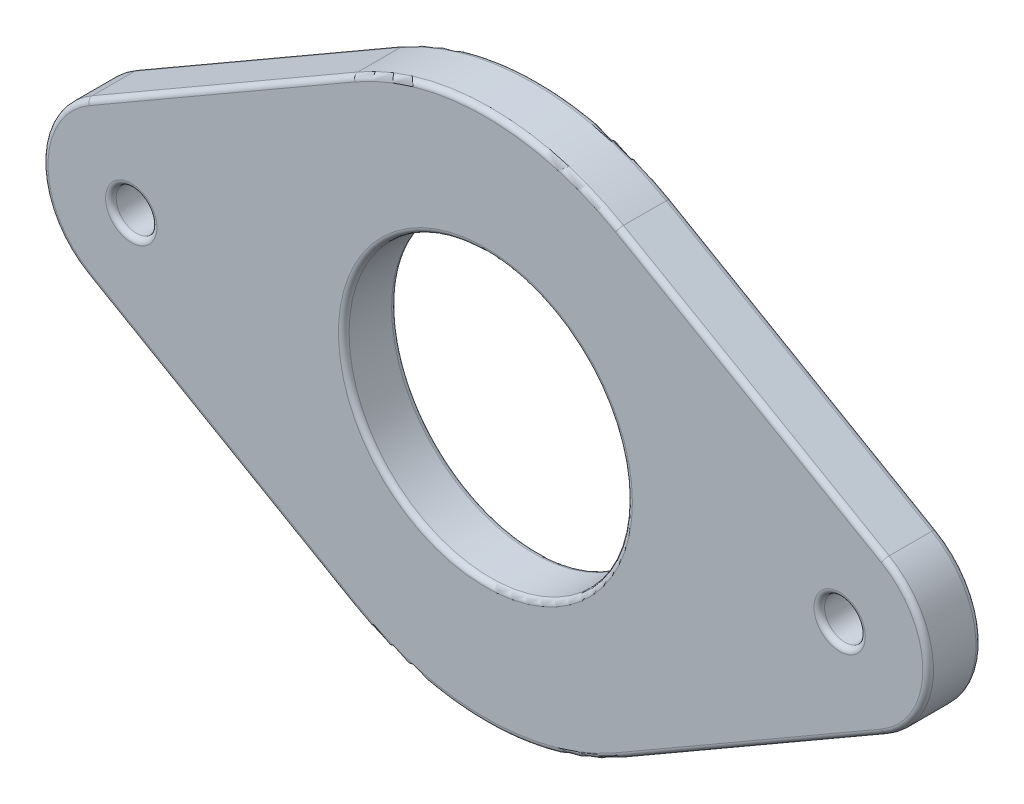
ISO-10303-21;
HEADER;
FILE_DESCRIPTION(('STEP AP214'),'2;1');
FILE_NAME('part.step','',(''),(''),'','','');
FILE_SCHEMA(('AUTOMOTIVE_DESIGN { 1 0 10303 214 1 1 1 1 }'));
ENDSEC;
DATA;
#1=APPLICATION_CONTEXT('core data for automotive mechanical design processes');
#2=APPLICATION_PROTOCOL_DEFINITION('international standard','automotive_design',2000,#1);
#3=PRODUCT_CONTEXT('',#1,'mechanical');
#4=PRODUCT('Part','Part','',(#3));
#5=PRODUCT_RELATED_PRODUCT_CATEGORY('part','',(#4));
#6=PRODUCT_DEFINITION_FORMATION('','',#4);
#7=PRODUCT_DEFINITION_CONTEXT('part definition',#1,'design');
#8=PRODUCT_DEFINITION('design','',#6,#7);
#9=PRODUCT_DEFINITION_SHAPE('','',#8);
#10=(LENGTH_UNIT() NAMED_UNIT(*) SI_UNIT(.MILLI.,.METRE.));
#11=(NAMED_UNIT(*) PLANE_ANGLE_UNIT() SI_UNIT($,.RADIAN.));
#12=(NAMED_UNIT(*) SI_UNIT($,.STERADIAN.) SOLID_ANGLE_UNIT());
#13=UNCERTAINTY_MEASURE_WITH_UNIT(LENGTH_MEASURE(1.E-05),#10,'distance_accuracy_value','');
#14=(GEOMETRIC_REPRESENTATION_CONTEXT(3) GLOBAL_UNCERTAINTY_ASSIGNED_CONTEXT((#13)) GLOBAL_UNIT_ASSIGNED_CONTEXT((#10,
#11,#12)) REPRESENTATION_CONTEXT('',''));
#15=CARTESIAN_POINT('',(0.,0.,0.));
#16=DIRECTION('',(0.,0.,1.));
#17=DIRECTION('',(1.,0.,0.));
#18=AXIS2_PLACEMENT_3D('',#15,#16,#17);
#19=CARTESIAN_POINT('',(-20.,0.,3.));
#20=DIRECTION('',(0.,0.,1.));
#21=DIRECTION('',(1.,0.,0.));
#22=AXIS2_PLACEMENT_3D('',#19,#20,#21);
#23=PLANE('',#22);
#24=CARTESIAN_POINT('',(20.,0.,3.));
#25=DIRECTION('',(0.,0.,1.));
#26=DIRECTION('',(1.,0.,0.));
#27=AXIS2_PLACEMENT_3D('',#24,#25,#26);
#28=CIRCLE('',#27,1.45);
#29=CARTESIAN_POINT('',(21.45,0.,3.));
#30=VERTEX_POINT('',#29);
#31=EDGE_CURVE('E11',#30,#30,#28,.F.);
#32=ORIENTED_EDGE('',*,*,#31,.T.);
#33=EDGE_LOOP('',(#32));
#34=FACE_BOUND('',#33,.T.);
#35=CARTESIAN_POINT('',(0.,0.,3.));
#36=DIRECTION('',(0.,0.,1.));
#37=DIRECTION('',(1.,0.,0.));
#38=AXIS2_PLACEMENT_3D('',#35,#36,#37);
#39=CIRCLE('',#38,8.3);
#40=CARTESIAN_POINT('',(8.3,0.,3.));
#41=VERTEX_POINT('',#40);
#42=EDGE_CURVE('E49',#41,#41,#39,.F.);
#43=ORIENTED_EDGE('',*,*,#42,.T.);
#44=EDGE_LOOP('',(#43));
#45=FACE_BOUND('',#44,.T.);
#46=CARTESIAN_POINT('',(0.,0.,3.));
#47=DIRECTION('',(0.,0.,1.));
#48=DIRECTION('',(1.,0.,0.));
#49=AXIS2_PLACEMENT_3D('',#46,#47,#48);
#50=CIRCLE('',#49,14.7);
#51=CARTESIAN_POINT('',(7.35,12.7305734356312,3.));
#52=VERTEX_POINT('',#51);
#53=CARTESIAN_POINT('',(-7.35,12.7305734356312,3.));
#54=VERTEX_POINT('',#53);
#55=EDGE_CURVE('E57',#52,#54,#50,.T.);
#56=ORIENTED_EDGE('',*,*,#55,.T.);
#57=DIRECTION('',(-0.866025403784439,-0.5,0.));
#58=VECTOR('',#57,1.);
#59=CARTESIAN_POINT('',(-22.35,4.07031939778686,3.));
#60=LINE('',#59,#58);
#61=CARTESIAN_POINT('',(-22.35,4.07031939778686,3.));
#62=VERTEX_POINT('',#61);
#63=EDGE_CURVE('E298',#54,#62,#60,.T.);
#64=ORIENTED_EDGE('',*,*,#63,.T.);
#65=CARTESIAN_POINT('',(-20.,0.,3.));
#66=DIRECTION('',(0.,0.,1.));
#67=DIRECTION('',(1.,0.,0.));
#68=AXIS2_PLACEMENT_3D('',#65,#66,#67);
#69=CIRCLE('',#68,4.7);
#70=CARTESIAN_POINT('',(-22.35,-4.07031939778686,3.));
#71=VERTEX_POINT('',#70);
#72=EDGE_CURVE('E279',#62,#71,#69,.T.);
#73=ORIENTED_EDGE('',*,*,#72,.T.);
#74=DIRECTION('',(0.866025403784439,-0.5,0.));
#75=VECTOR('',#74,1.);
#76=CARTESIAN_POINT('',(-7.35,-12.7305734356313,3.));
#77=LINE('',#76,#75);
#78=CARTESIAN_POINT('',(-7.34999999999999,-12.7305734356313,3.));
#79=VERTEX_POINT('',#78);
#80=EDGE_CURVE('E282',#71,#79,#77,.T.);
#81=ORIENTED_EDGE('',*,*,#80,.T.);
#82=CARTESIAN_POINT('',(0.,0.,3.));
#83=DIRECTION('',(0.,0.,1.));
#84=DIRECTION('',(1.,0.,0.));
#85=AXIS2_PLACEMENT_3D('',#82,#83,#84);
#86=CIRCLE('',#85,14.7);
#87=CARTESIAN_POINT('',(7.35,-12.7305734356312,3.));
#88=VERTEX_POINT('',#87);
#89=EDGE_CURVE('E285',#79,#88,#86,.T.);
#90=ORIENTED_EDGE('',*,*,#89,.T.);
#91=DIRECTION('',(0.866025403784439,0.5,0.));
#92=VECTOR('',#91,1.);
#93=CARTESIAN_POINT('',(22.35,-4.07031939778685,3.));
#94=LINE('',#93,#92);
#95=CARTESIAN_POINT('',(22.35,-4.07031939778685,3.));
#96=VERTEX_POINT('',#95);
#97=EDGE_CURVE('E288',#88,#96,#94,.T.);
#98=ORIENTED_EDGE('',*,*,#97,.T.);
#99=CARTESIAN_POINT('',(20.,0.,3.));
#100=DIRECTION('',(0.,0.,1.));
#101=DIRECTION('',(1.,0.,0.));
#102=AXIS2_PLACEMENT_3D('',#99,#100,#101);
#103=CIRCLE('',#102,4.7);
#104=CARTESIAN_POINT('',(22.35,4.07031939778687,3.));
#105=VERTEX_POINT('',#104);
#106=EDGE_CURVE('E291',#96,#105,#103,.T.);
#107=ORIENTED_EDGE('',*,*,#106,.T.);
#108=DIRECTION('',(-0.866025403784439,0.5,0.));
#109=VECTOR('',#108,1.);
#110=CARTESIAN_POINT('',(7.35,12.7305734356312,3.));
#111=LINE('',#110,#109);
#112=EDGE_CURVE('E62',#105,#52,#111,.T.);
#113=ORIENTED_EDGE('',*,*,#112,.T.);
#114=EDGE_LOOP('',(#56,#64,#73,#81,#90,#98,#107,#113));
#115=FACE_BOUND('',#114,.T.);
#116=CARTESIAN_POINT('',(-20.,0.,3.));
#117=DIRECTION('',(0.,0.,1.));
#118=DIRECTION('',(1.,0.,0.));
#119=AXIS2_PLACEMENT_3D('',#116,#117,#118);
#120=CIRCLE('',#119,1.45);
#121=CARTESIAN_POINT('',(-18.55,0.,3.));
#122=VERTEX_POINT('',#121);
#123=EDGE_CURVE('E275',#122,#122,#120,.F.);
#124=ORIENTED_EDGE('',*,*,#123,.T.);
#125=EDGE_LOOP('',(#124));
#126=FACE_BOUND('',#125,.T.);
#127=ADVANCED_FACE('F39',(#34,#45,#115,#126),#23,.T.);
#128=CARTESIAN_POINT('',(-20.,0.,0.));
#129=DIRECTION('',(0.,0.,1.));
#130=DIRECTION('',(1.,0.,0.));
#131=AXIS2_PLACEMENT_3D('',#128,#129,#130);
#132=PLANE('',#131);
#133=CARTESIAN_POINT('',(20.,0.,0.));
#134=DIRECTION('',(0.,0.,1.));
#135=DIRECTION('',(1.,0.,0.));
#136=AXIS2_PLACEMENT_3D('',#133,#134,#135);
#137=CIRCLE('',#136,1.45);
#138=CARTESIAN_POINT('',(21.45,0.,0.));
#139=VERTEX_POINT('',#138);
#140=EDGE_CURVE('E199',#139,#139,#137,.T.);
#141=ORIENTED_EDGE('',*,*,#140,.T.);
#142=EDGE_LOOP('',(#141));
#143=FACE_BOUND('',#142,.T.);
#144=CARTESIAN_POINT('',(-20.,0.,0.));
#145=DIRECTION('',(0.,0.,1.));
#146=DIRECTION('',(1.,0.,0.));
#147=AXIS2_PLACEMENT_3D('',#144,#145,#146);
#148=CIRCLE('',#147,1.45);
#149=CARTESIAN_POINT('',(-18.55,0.,0.));
#150=VERTEX_POINT('',#149);
#151=EDGE_CURVE('E190',#150,#150,#148,.T.);
#152=ORIENTED_EDGE('',*,*,#151,.T.);
#153=EDGE_LOOP('',(#152));
#154=FACE_BOUND('',#153,.T.);
#155=CARTESIAN_POINT('',(0.,0.,0.));
#156=DIRECTION('',(0.,0.,1.));
#157=DIRECTION('',(1.,0.,0.));
#158=AXIS2_PLACEMENT_3D('',#155,#156,#157);
#159=CIRCLE('',#158,8.3);
#160=CARTESIAN_POINT('',(8.3,0.,0.));
#161=VERTEX_POINT('',#160);
#162=EDGE_CURVE('E185',#161,#161,#159,.T.);
#163=ORIENTED_EDGE('',*,*,#162,.T.);
#164=EDGE_LOOP('',(#163));
#165=FACE_BOUND('',#164,.T.);
#166=CARTESIAN_POINT('',(0.,0.,0.));
#167=DIRECTION('',(0.,0.,1.));
#168=DIRECTION('',(1.,0.,0.));
#169=AXIS2_PLACEMENT_3D('',#166,#167,#168);
#170=CIRCLE('',#169,14.7);
#171=CARTESIAN_POINT('',(7.35,-12.7305734356312,0.));
#172=VERTEX_POINT('',#171);
#173=CARTESIAN_POINT('',(-7.34999999999999,-12.7305734356313,0.));
#174=VERTEX_POINT('',#173);
#175=EDGE_CURVE('E183',#172,#174,#170,.F.);
#176=ORIENTED_EDGE('',*,*,#175,.T.);
#177=DIRECTION('',(0.866025403784439,-0.5,0.));
#178=VECTOR('',#177,1.);
#179=CARTESIAN_POINT('',(-22.35,-4.07031939778686,0.));
#180=LINE('',#179,#178);
#181=CARTESIAN_POINT('',(-22.35,-4.07031939778686,0.));
#182=VERTEX_POINT('',#181);
#183=EDGE_CURVE('E160',#174,#182,#180,.F.);
#184=ORIENTED_EDGE('',*,*,#183,.T.);
#185=CARTESIAN_POINT('',(-20.,0.,0.));
#186=DIRECTION('',(0.,0.,1.));
#187=DIRECTION('',(1.,0.,0.));
#188=AXIS2_PLACEMENT_3D('',#185,#186,#187);
#189=CIRCLE('',#188,4.7);
#190=CARTESIAN_POINT('',(-22.35,4.07031939778686,0.));
#191=VERTEX_POINT('',#190);
#192=EDGE_CURVE('E171',#182,#191,#189,.F.);
#193=ORIENTED_EDGE('',*,*,#192,.T.);
#194=DIRECTION('',(-0.866025403784439,-0.5,0.));
#195=VECTOR('',#194,1.);
#196=CARTESIAN_POINT('',(-22.35,4.07031939778686,0.));
#197=LINE('',#196,#195);
#198=CARTESIAN_POINT('',(-7.35,12.7305734356312,0.));
#199=VERTEX_POINT('',#198);
#200=EDGE_CURVE('E178',#191,#199,#197,.F.);
#201=ORIENTED_EDGE('',*,*,#200,.T.);
#202=CARTESIAN_POINT('',(0.,0.,0.));
#203=DIRECTION('',(0.,0.,1.));
#204=DIRECTION('',(1.,0.,0.));
#205=AXIS2_PLACEMENT_3D('',#202,#203,#204);
#206=CIRCLE('',#205,14.7);
#207=CARTESIAN_POINT('',(7.35,12.7305734356312,0.));
#208=VERTEX_POINT('',#207);
#209=EDGE_CURVE('E397',#199,#208,#206,.F.);
#210=ORIENTED_EDGE('',*,*,#209,.T.);
#211=DIRECTION('',(-0.866025403784439,0.5,0.));
#212=VECTOR('',#211,1.);
#213=CARTESIAN_POINT('',(-7.65000000000002,21.3908274734756,0.));
#214=LINE('',#213,#212);
#215=CARTESIAN_POINT('',(22.35,4.07031939778687,0.));
#216=VERTEX_POINT('',#215);
#217=EDGE_CURVE('E400',#208,#216,#214,.F.);
#218=ORIENTED_EDGE('',*,*,#217,.T.);
#219=CARTESIAN_POINT('',(20.,0.,0.));
#220=DIRECTION('',(0.,0.,1.));
#221=DIRECTION('',(1.,0.,0.));
#222=AXIS2_PLACEMENT_3D('',#219,#220,#221);
#223=CIRCLE('',#222,4.7);
#224=CARTESIAN_POINT('',(22.35,-4.07031939778686,0.));
#225=VERTEX_POINT('',#224);
#226=EDGE_CURVE('E403',#216,#225,#223,.F.);
#227=ORIENTED_EDGE('',*,*,#226,.T.);
#228=DIRECTION('',(0.866025403784439,0.5,0.));
#229=VECTOR('',#228,1.);
#230=CARTESIAN_POINT('',(-7.64999999999999,-21.3908274734756,0.));
#231=LINE('',#230,#229);
#232=EDGE_CURVE('E192',#225,#172,#231,.F.);
#233=ORIENTED_EDGE('',*,*,#232,.T.);
#234=EDGE_LOOP('',(#176,#184,#193,#201,#210,#218,#227,#233));
#235=FACE_BOUND('',#234,.T.);
#236=ADVANCED_FACE('F181',(#143,#154,#165,#235),#132,.F.);
#237=CARTESIAN_POINT('',(-20.,0.,3.));
#238=DIRECTION('',(0.,0.,-1.));
#239=DIRECTION('',(-1.,0.,0.));
#240=AXIS2_PLACEMENT_3D('',#237,#238,#239);
#241=CYLINDRICAL_SURFACE('',#240,5.);
#242=DIRECTION('',(0.,0.,-1.));
#243=VECTOR('',#242,1.);
#244=CARTESIAN_POINT('',(-22.5,4.3301270189222,3.));
#245=LINE('',#244,#243);
#246=CARTESIAN_POINT('',(-22.5,4.3301270189222,2.7));
#247=VERTEX_POINT('',#246);
#248=CARTESIAN_POINT('',(-22.5,4.3301270189222,0.3));
#249=VERTEX_POINT('',#248);
#250=EDGE_CURVE('E327',#247,#249,#245,.T.);
#251=ORIENTED_EDGE('',*,*,#250,.T.);
#252=CARTESIAN_POINT('',(-20.,0.,0.3));
#253=DIRECTION('',(0.,0.,1.));
#254=DIRECTION('',(1.,0.,0.));
#255=AXIS2_PLACEMENT_3D('',#252,#253,#254);
#256=CIRCLE('',#255,5.);
#257=CARTESIAN_POINT('',(-22.5,-4.3301270189222,0.3));
#258=VERTEX_POINT('',#257);
#259=EDGE_CURVE('E272',#249,#258,#256,.T.);
#260=ORIENTED_EDGE('',*,*,#259,.T.);
#261=DIRECTION('',(0.,0.,-1.));
#262=VECTOR('',#261,1.);
#263=CARTESIAN_POINT('',(-22.5,-4.3301270189222,3.));
#264=LINE('',#263,#262);
#265=CARTESIAN_POINT('',(-22.5,-4.3301270189222,2.7));
#266=VERTEX_POINT('',#265);
#267=EDGE_CURVE('E179',#266,#258,#264,.T.);
#268=ORIENTED_EDGE('',*,*,#267,.F.);
#269=CARTESIAN_POINT('',(-20.,0.,2.7));
#270=DIRECTION('',(0.,0.,1.));
#271=DIRECTION('',(1.,0.,0.));
#272=AXIS2_PLACEMENT_3D('',#269,#270,#271);
#273=CIRCLE('',#272,5.);
#274=EDGE_CURVE('E269',#266,#247,#273,.F.);
#275=ORIENTED_EDGE('',*,*,#274,.T.);
#276=EDGE_LOOP('',(#251,#260,#268,#275));
#277=FACE_BOUND('',#276,.T.);
#278=ADVANCED_FACE('F422',(#277),#241,.T.);
#279=CARTESIAN_POINT('',(-22.5,-4.3301270189222,3.));
#280=DIRECTION('',(0.5,0.866025403784439,0.));
#281=DIRECTION('',(-0.866025403784439,0.5,0.));
#282=AXIS2_PLACEMENT_3D('',#279,#280,#281);
#283=PLANE('',#282);
#284=ORIENTED_EDGE('',*,*,#267,.T.);
#285=DIRECTION('',(0.866025403784439,-0.5,0.));
#286=VECTOR('',#285,1.);
#287=CARTESIAN_POINT('',(-22.5,-4.3301270189222,0.3));
#288=LINE('',#287,#286);
#289=CARTESIAN_POINT('',(-7.49999999999999,-12.9903810567666,0.3));
#290=VERTEX_POINT('',#289);
#291=EDGE_CURVE('E163',#258,#290,#288,.T.);
#292=ORIENTED_EDGE('',*,*,#291,.T.);
#293=DIRECTION('',(0.,0.,-1.));
#294=VECTOR('',#293,1.);
#295=CARTESIAN_POINT('',(-7.49999999999999,-12.9903810567666,3.));
#296=LINE('',#295,#294);
#297=CARTESIAN_POINT('',(-7.49999999999999,-12.9903810567666,2.7));
#298=VERTEX_POINT('',#297);
#299=EDGE_CURVE('E383',#298,#290,#296,.T.);
#300=ORIENTED_EDGE('',*,*,#299,.F.);
#301=DIRECTION('',(0.866025403784439,-0.5,0.));
#302=VECTOR('',#301,1.);
#303=CARTESIAN_POINT('',(-22.5,-4.3301270189222,2.7));
#304=LINE('',#303,#302);
#305=EDGE_CURVE('E227',#298,#266,#304,.F.);
#306=ORIENTED_EDGE('',*,*,#305,.T.);
#307=EDGE_LOOP('',(#284,#292,#300,#306));
#308=FACE_BOUND('',#307,.T.);
#309=ADVANCED_FACE('F415',(#308),#283,.F.);
#310=CARTESIAN_POINT('',(0.,0.,3.));
#311=DIRECTION('',(0.,0.,-1.));
#312=DIRECTION('',(-1.,0.,0.));
#313=AXIS2_PLACEMENT_3D('',#310,#311,#312);
#314=CYLINDRICAL_SURFACE('',#313,15.);
#315=ORIENTED_EDGE('',*,*,#299,.T.);
#316=CARTESIAN_POINT('',(0.,0.,0.3));
#317=DIRECTION('',(0.,0.,1.));
#318=DIRECTION('',(1.,0.,0.));
#319=AXIS2_PLACEMENT_3D('',#316,#317,#318);
#320=CIRCLE('',#319,15.);
#321=CARTESIAN_POINT('',(7.5,-12.9903810567666,0.3));
#322=VERTEX_POINT('',#321);
#323=EDGE_CURVE('E235',#290,#322,#320,.T.);
#324=ORIENTED_EDGE('',*,*,#323,.T.);
#325=DIRECTION('',(0.,0.,-1.));
#326=VECTOR('',#325,1.);
#327=CARTESIAN_POINT('',(7.5,-12.9903810567666,3.));
#328=LINE('',#327,#326);
#329=CARTESIAN_POINT('',(7.5,-12.9903810567666,2.7));
#330=VERTEX_POINT('',#329);
#331=EDGE_CURVE('E373',#330,#322,#328,.T.);
#332=ORIENTED_EDGE('',*,*,#331,.F.);
#333=CARTESIAN_POINT('',(0.,0.,2.7));
#334=DIRECTION('',(0.,0.,1.));
#335=DIRECTION('',(1.,0.,0.));
#336=AXIS2_PLACEMENT_3D('',#333,#334,#335);
#337=CIRCLE('',#336,15.);
#338=EDGE_CURVE('E232',#330,#298,#337,.F.);
#339=ORIENTED_EDGE('',*,*,#338,.T.);
#340=EDGE_LOOP('',(#315,#324,#332,#339));
#341=FACE_BOUND('',#340,.T.);
#342=ADVANCED_FACE('F379',(#341),#314,.T.);
#343=CARTESIAN_POINT('',(7.5,-12.9903810567666,3.));
#344=DIRECTION('',(-0.5,0.866025403784439,0.));
#345=DIRECTION('',(-0.866025403784439,-0.5,0.));
#346=AXIS2_PLACEMENT_3D('',#343,#344,#345);
#347=PLANE('',#346);
#348=ORIENTED_EDGE('',*,*,#331,.T.);
#349=DIRECTION('',(0.866025403784439,0.5,0.));
#350=VECTOR('',#349,1.);
#351=CARTESIAN_POINT('',(7.5,-12.9903810567666,0.3));
#352=LINE('',#351,#350);
#353=CARTESIAN_POINT('',(22.5,-4.33012701892219,0.3));
#354=VERTEX_POINT('',#353);
#355=EDGE_CURVE('E241',#322,#354,#352,.T.);
#356=ORIENTED_EDGE('',*,*,#355,.T.);
#357=DIRECTION('',(0.,0.,-1.));
#358=VECTOR('',#357,1.);
#359=CARTESIAN_POINT('',(22.5,-4.33012701892219,3.));
#360=LINE('',#359,#358);
#361=CARTESIAN_POINT('',(22.5,-4.33012701892219,2.7));
#362=VERTEX_POINT('',#361);
#363=EDGE_CURVE('E376',#362,#354,#360,.T.);
#364=ORIENTED_EDGE('',*,*,#363,.F.);
#365=DIRECTION('',(0.866025403784439,0.5,0.));
#366=VECTOR('',#365,1.);
#367=CARTESIAN_POINT('',(7.5,-12.9903810567666,2.7));
#368=LINE('',#367,#366);
#369=EDGE_CURVE('E238',#362,#330,#368,.F.);
#370=ORIENTED_EDGE('',*,*,#369,.T.);
#371=EDGE_LOOP('',(#348,#356,#364,#370));
#372=FACE_BOUND('',#371,.T.);
#373=ADVANCED_FACE('F372',(#372),#347,.F.);
#374=CARTESIAN_POINT('',(20.,0.,3.));
#375=DIRECTION('',(0.,0.,-1.));
#376=DIRECTION('',(-1.,0.,0.));
#377=AXIS2_PLACEMENT_3D('',#374,#375,#376);
#378=CYLINDRICAL_SURFACE('',#377,5.);
#379=ORIENTED_EDGE('',*,*,#363,.T.);
#380=CARTESIAN_POINT('',(20.,0.,0.3));
#381=DIRECTION('',(0.,0.,1.));
#382=DIRECTION('',(1.,0.,0.));
#383=AXIS2_PLACEMENT_3D('',#380,#381,#382);
#384=CIRCLE('',#383,5.);
#385=CARTESIAN_POINT('',(22.5,4.3301270189222,0.3));
#386=VERTEX_POINT('',#385);
#387=EDGE_CURVE('E247',#354,#386,#384,.T.);
#388=ORIENTED_EDGE('',*,*,#387,.T.);
#389=DIRECTION('',(0.,0.,-1.));
#390=VECTOR('',#389,1.);
#391=CARTESIAN_POINT('',(22.5,4.3301270189222,3.));
#392=LINE('',#391,#390);
#393=CARTESIAN_POINT('',(22.5,4.3301270189222,2.7));
#394=VERTEX_POINT('',#393);
#395=EDGE_CURVE('E388',#394,#386,#392,.T.);
#396=ORIENTED_EDGE('',*,*,#395,.F.);
#397=CARTESIAN_POINT('',(20.,0.,2.7));
#398=DIRECTION('',(0.,0.,1.));
#399=DIRECTION('',(1.,0.,0.));
#400=AXIS2_PLACEMENT_3D('',#397,#398,#399);
#401=CIRCLE('',#400,5.);
#402=EDGE_CURVE('E244',#394,#362,#401,.F.);
#403=ORIENTED_EDGE('',*,*,#402,.T.);
#404=EDGE_LOOP('',(#379,#388,#396,#403));
#405=FACE_BOUND('',#404,.T.);
#406=ADVANCED_FACE('F471',(#405),#378,.T.);
#407=CARTESIAN_POINT('',(7.5,12.9903810567666,3.));
#408=DIRECTION('',(-0.5,-0.866025403784439,0.));
#409=DIRECTION('',(0.866025403784439,-0.5,0.));
#410=AXIS2_PLACEMENT_3D('',#407,#408,#409);
#411=PLANE('',#410);
#412=ORIENTED_EDGE('',*,*,#395,.T.);
#413=DIRECTION('',(-0.866025403784439,0.5,0.));
#414=VECTOR('',#413,1.);
#415=CARTESIAN_POINT('',(7.5,12.9903810567666,0.3));
#416=LINE('',#415,#414);
#417=CARTESIAN_POINT('',(7.5,12.9903810567666,0.3));
#418=VERTEX_POINT('',#417);
#419=EDGE_CURVE('E253',#386,#418,#416,.T.);
#420=ORIENTED_EDGE('',*,*,#419,.T.);
#421=DIRECTION('',(0.,0.,-1.));
#422=VECTOR('',#421,1.);
#423=CARTESIAN_POINT('',(7.5,12.9903810567666,3.));
#424=LINE('',#423,#422);
#425=CARTESIAN_POINT('',(7.5,12.9903810567666,2.7));
#426=VERTEX_POINT('',#425);
#427=EDGE_CURVE('E449',#426,#418,#424,.T.);
#428=ORIENTED_EDGE('',*,*,#427,.F.);
#429=DIRECTION('',(-0.866025403784439,0.5,0.));
#430=VECTOR('',#429,1.);
#431=CARTESIAN_POINT('',(22.5,4.33012701892221,2.7));
#432=LINE('',#431,#430);
#433=EDGE_CURVE('E250',#426,#394,#432,.F.);
#434=ORIENTED_EDGE('',*,*,#433,.T.);
#435=EDGE_LOOP('',(#412,#420,#428,#434));
#436=FACE_BOUND('',#435,.T.);
#437=ADVANCED_FACE('F460',(#436),#411,.F.);
#438=CARTESIAN_POINT('',(0.,0.,3.));
#439=DIRECTION('',(0.,0.,-1.));
#440=DIRECTION('',(-1.,0.,0.));
#441=AXIS2_PLACEMENT_3D('',#438,#439,#440);
#442=CYLINDRICAL_SURFACE('',#441,15.);
#443=ORIENTED_EDGE('',*,*,#427,.T.);
#444=CARTESIAN_POINT('',(0.,0.,0.3));
#445=DIRECTION('',(0.,0.,1.));
#446=DIRECTION('',(1.,0.,0.));
#447=AXIS2_PLACEMENT_3D('',#444,#445,#446);
#448=CIRCLE('',#447,15.);
#449=CARTESIAN_POINT('',(-7.5,12.9903810567666,0.3));
#450=VERTEX_POINT('',#449);
#451=EDGE_CURVE('E259',#418,#450,#448,.T.);
#452=ORIENTED_EDGE('',*,*,#451,.T.);
#453=DIRECTION('',(0.,0.,-1.));
#454=VECTOR('',#453,1.);
#455=CARTESIAN_POINT('',(-7.5,12.9903810567666,3.));
#456=LINE('',#455,#454);
#457=CARTESIAN_POINT('',(-7.5,12.9903810567666,2.7));
#458=VERTEX_POINT('',#457);
#459=EDGE_CURVE('E441',#458,#450,#456,.T.);
#460=ORIENTED_EDGE('',*,*,#459,.F.);
#461=CARTESIAN_POINT('',(0.,0.,2.7));
#462=DIRECTION('',(0.,0.,1.));
#463=DIRECTION('',(1.,0.,0.));
#464=AXIS2_PLACEMENT_3D('',#461,#462,#463);
#465=CIRCLE('',#464,15.);
#466=EDGE_CURVE('E256',#458,#426,#465,.F.);
#467=ORIENTED_EDGE('',*,*,#466,.T.);
#468=EDGE_LOOP('',(#443,#452,#460,#467));
#469=FACE_BOUND('',#468,.T.);
#470=ADVANCED_FACE('F445',(#469),#442,.T.);
#471=CARTESIAN_POINT('',(-22.5,4.3301270189222,3.));
#472=DIRECTION('',(0.5,-0.866025403784439,0.));
#473=DIRECTION('',(0.866025403784439,0.5,0.));
#474=AXIS2_PLACEMENT_3D('',#471,#472,#473);
#475=PLANE('',#474);
#476=ORIENTED_EDGE('',*,*,#459,.T.);
#477=DIRECTION('',(-0.866025403784439,-0.5,0.));
#478=VECTOR('',#477,1.);
#479=CARTESIAN_POINT('',(-22.5,4.3301270189222,0.3));
#480=LINE('',#479,#478);
#481=EDGE_CURVE('E266',#450,#249,#480,.T.);
#482=ORIENTED_EDGE('',*,*,#481,.T.);
#483=ORIENTED_EDGE('',*,*,#250,.F.);
#484=DIRECTION('',(-0.866025403784439,-0.5,0.));
#485=VECTOR('',#484,1.);
#486=CARTESIAN_POINT('',(-7.5,12.9903810567666,2.7));
#487=LINE('',#486,#485);
#488=EDGE_CURVE('E262',#247,#458,#487,.F.);
#489=ORIENTED_EDGE('',*,*,#488,.T.);
#490=EDGE_LOOP('',(#476,#482,#483,#489));
#491=FACE_BOUND('',#490,.T.);
#492=ADVANCED_FACE('F440',(#491),#475,.F.);
#493=CARTESIAN_POINT('',(0.,0.,3.));
#494=DIRECTION('',(0.,0.,-1.));
#495=DIRECTION('',(-1.,0.,0.));
#496=AXIS2_PLACEMENT_3D('',#493,#494,#495);
#497=CYLINDRICAL_SURFACE('',#496,8.);
#498=CARTESIAN_POINT('',(0.,0.,0.3));
#499=DIRECTION('',(0.,0.,1.));
#500=DIRECTION('',(1.,0.,0.));
#501=AXIS2_PLACEMENT_3D('',#498,#499,#500);
#502=CIRCLE('',#501,8.);
#503=CARTESIAN_POINT('',(8.,0.,0.3));
#504=VERTEX_POINT('',#503);
#505=EDGE_CURVE('E223',#504,#504,#502,.F.);
#506=ORIENTED_EDGE('',*,*,#505,.T.);
#507=EDGE_LOOP('',(#506));
#508=FACE_BOUND('',#507,.T.);
#509=CARTESIAN_POINT('',(0.,0.,2.7));
#510=DIRECTION('',(0.,0.,1.));
#511=DIRECTION('',(1.,0.,0.));
#512=AXIS2_PLACEMENT_3D('',#509,#510,#511);
#513=CIRCLE('',#512,8.);
#514=CARTESIAN_POINT('',(8.,0.,2.7));
#515=VERTEX_POINT('',#514);
#516=EDGE_CURVE('E219',#515,#515,#513,.T.);
#517=ORIENTED_EDGE('',*,*,#516,.T.);
#518=EDGE_LOOP('',(#517));
#519=FACE_BOUND('',#518,.T.);
#520=ADVANCED_FACE('F490',(#508,#519),#497,.F.);
#521=CARTESIAN_POINT('',(-20.,0.,3.));
#522=DIRECTION('',(0.,0.,-1.));
#523=DIRECTION('',(-1.,0.,0.));
#524=AXIS2_PLACEMENT_3D('',#521,#522,#523);
#525=CYLINDRICAL_SURFACE('',#524,1.15);
#526=CARTESIAN_POINT('',(-20.,0.,0.3));
#527=DIRECTION('',(0.,0.,1.));
#528=DIRECTION('',(1.,0.,0.));
#529=AXIS2_PLACEMENT_3D('',#526,#527,#528);
#530=CIRCLE('',#529,1.15);
#531=CARTESIAN_POINT('',(-18.85,0.,0.3));
#532=VERTEX_POINT('',#531);
#533=EDGE_CURVE('E215',#532,#532,#530,.F.);
#534=ORIENTED_EDGE('',*,*,#533,.T.);
#535=EDGE_LOOP('',(#534));
#536=FACE_BOUND('',#535,.T.);
#537=CARTESIAN_POINT('',(-20.,0.,2.7));
#538=DIRECTION('',(0.,0.,1.));
#539=DIRECTION('',(1.,0.,0.));
#540=AXIS2_PLACEMENT_3D('',#537,#538,#539);
#541=CIRCLE('',#540,1.15);
#542=CARTESIAN_POINT('',(-18.85,0.,2.7));
#543=VERTEX_POINT('',#542);
#544=EDGE_CURVE('E211',#543,#543,#541,.T.);
#545=ORIENTED_EDGE('',*,*,#544,.T.);
#546=EDGE_LOOP('',(#545));
#547=FACE_BOUND('',#546,.T.);
#548=ADVANCED_FACE('F510',(#536,#547),#525,.F.);
#549=CARTESIAN_POINT('',(20.,0.,3.));
#550=DIRECTION('',(0.,0.,-1.));
#551=DIRECTION('',(-1.,0.,0.));
#552=AXIS2_PLACEMENT_3D('',#549,#550,#551);
#553=CYLINDRICAL_SURFACE('',#552,1.15);
#554=CARTESIAN_POINT('',(20.,0.,0.3));
#555=DIRECTION('',(0.,0.,1.));
#556=DIRECTION('',(1.,0.,0.));
#557=AXIS2_PLACEMENT_3D('',#554,#555,#556);
#558=CIRCLE('',#557,1.15);
#559=CARTESIAN_POINT('',(21.15,0.,0.3));
#560=VERTEX_POINT('',#559);
#561=EDGE_CURVE('E207',#560,#560,#558,.F.);
#562=ORIENTED_EDGE('',*,*,#561,.T.);
#563=EDGE_LOOP('',(#562));
#564=FACE_BOUND('',#563,.T.);
#565=CARTESIAN_POINT('',(20.,0.,2.7));
#566=DIRECTION('',(0.,0.,1.));
#567=DIRECTION('',(1.,0.,0.));
#568=AXIS2_PLACEMENT_3D('',#565,#566,#567);
#569=CIRCLE('',#568,1.15);
#570=CARTESIAN_POINT('',(21.15,0.,2.7));
#571=VERTEX_POINT('',#570);
#572=EDGE_CURVE('E203',#571,#571,#569,.T.);
#573=ORIENTED_EDGE('',*,*,#572,.T.);
#574=EDGE_LOOP('',(#573));
#575=FACE_BOUND('',#574,.T.);
#576=ADVANCED_FACE('F517',(#564,#575),#553,.F.);
#577=CARTESIAN_POINT('',(20.,0.,0.3));
#578=DIRECTION('',(0.,0.,1.));
#579=DIRECTION('',(1.,0.,0.));
#580=AXIS2_PLACEMENT_3D('',#577,#578,#579);
#581=TOROIDAL_SURFACE('',#580,1.45,0.3);
#582=ORIENTED_EDGE('',*,*,#561,.F.);
#583=EDGE_LOOP('',(#582));
#584=FACE_BOUND('',#583,.T.);
#585=ORIENTED_EDGE('',*,*,#140,.F.);
#586=EDGE_LOOP('',(#585));
#587=FACE_BOUND('',#586,.T.);
#588=ADVANCED_FACE('F524',(#584,#587),#581,.T.);
#589=CARTESIAN_POINT('',(-20.,0.,0.3));
#590=DIRECTION('',(0.,0.,1.));
#591=DIRECTION('',(1.,0.,0.));
#592=AXIS2_PLACEMENT_3D('',#589,#590,#591);
#593=TOROIDAL_SURFACE('',#592,1.45,0.3);
#594=ORIENTED_EDGE('',*,*,#533,.F.);
#595=EDGE_LOOP('',(#594));
#596=FACE_BOUND('',#595,.T.);
#597=ORIENTED_EDGE('',*,*,#151,.F.);
#598=EDGE_LOOP('',(#597));
#599=FACE_BOUND('',#598,.T.);
#600=ADVANCED_FACE('F532',(#596,#599),#593,.T.);
#601=CARTESIAN_POINT('',(0.,0.,0.3));
#602=DIRECTION('',(0.,0.,1.));
#603=DIRECTION('',(1.,0.,0.));
#604=AXIS2_PLACEMENT_3D('',#601,#602,#603);
#605=TOROIDAL_SURFACE('',#604,8.3,0.3);
#606=ORIENTED_EDGE('',*,*,#505,.F.);
#607=EDGE_LOOP('',(#606));
#608=FACE_BOUND('',#607,.T.);
#609=ORIENTED_EDGE('',*,*,#162,.F.);
#610=EDGE_LOOP('',(#609));
#611=FACE_BOUND('',#610,.T.);
#612=ADVANCED_FACE('F540',(#608,#611),#605,.T.);
#613=CARTESIAN_POINT('',(7.35,12.7305734356312,0.3));
#614=DIRECTION('',(-0.866025403784439,0.5,0.));
#615=DIRECTION('',(-0.5,-0.866025403784439,0.));
#616=AXIS2_PLACEMENT_3D('',#613,#614,#615);
#617=CYLINDRICAL_SURFACE('',#616,0.3);
#618=CARTESIAN_POINT('',(22.35,4.07031939778687,0.3));
#619=DIRECTION('',(0.866025403784437,-0.500000000000002,0.));
#620=DIRECTION('',(0.500000000000002,0.866025403784437,0.));
#621=AXIS2_PLACEMENT_3D('',#618,#619,#620);
#622=CIRCLE('',#621,0.3);
#623=EDGE_CURVE('E319',#216,#386,#622,.T.);
#624=ORIENTED_EDGE('',*,*,#623,.F.);
#625=ORIENTED_EDGE('',*,*,#217,.F.);
#626=CARTESIAN_POINT('',(7.35,12.7305734356312,0.3));
#627=DIRECTION('',(-0.866025403784439,0.5,0.));
#628=DIRECTION('',(-0.5,-0.866025403784439,0.));
#629=AXIS2_PLACEMENT_3D('',#626,#627,#628);
#630=CIRCLE('',#629,0.3);
#631=EDGE_CURVE('E323',#418,#208,#630,.T.);
#632=ORIENTED_EDGE('',*,*,#631,.F.);
#633=ORIENTED_EDGE('',*,*,#419,.F.);
#634=EDGE_LOOP('',(#624,#625,#632,#633));
#635=FACE_BOUND('',#634,.T.);
#636=ADVANCED_FACE('F466',(#635),#617,.T.);
#637=CARTESIAN_POINT('',(0.,0.,0.3));
#638=DIRECTION('',(0.,0.,1.));
#639=DIRECTION('',(1.,0.,0.));
#640=AXIS2_PLACEMENT_3D('',#637,#638,#639);
#641=TOROIDAL_SURFACE('',#640,14.7,0.3);
#642=ORIENTED_EDGE('',*,*,#631,.T.);
#643=ORIENTED_EDGE('',*,*,#209,.F.);
#644=CARTESIAN_POINT('',(-7.35,12.7305734356312,0.3));
#645=DIRECTION('',(-0.866025403784439,-0.5,0.));
#646=DIRECTION('',(0.5,-0.866025403784439,0.));
#647=AXIS2_PLACEMENT_3D('',#644,#645,#646);
#648=CIRCLE('',#647,0.3);
#649=EDGE_CURVE('E315',#450,#199,#648,.T.);
#650=ORIENTED_EDGE('',*,*,#649,.F.);
#651=ORIENTED_EDGE('',*,*,#451,.F.);
#652=EDGE_LOOP('',(#642,#643,#650,#651));
#653=FACE_BOUND('',#652,.T.);
#654=ADVANCED_FACE('F555',(#653),#641,.T.);
#655=CARTESIAN_POINT('',(20.,0.,0.3));
#656=DIRECTION('',(0.,0.,1.));
#657=DIRECTION('',(1.,0.,0.));
#658=AXIS2_PLACEMENT_3D('',#655,#656,#657);
#659=TOROIDAL_SURFACE('',#658,4.7,0.3);
#660=ORIENTED_EDGE('',*,*,#623,.T.);
#661=ORIENTED_EDGE('',*,*,#387,.F.);
#662=CARTESIAN_POINT('',(22.35,-4.07031939778686,0.3));
#663=DIRECTION('',(-0.866025403784436,-0.500000000000004,0.));
#664=DIRECTION('',(0.500000000000004,-0.866025403784437,0.));
#665=AXIS2_PLACEMENT_3D('',#662,#663,#664);
#666=CIRCLE('',#665,0.3);
#667=EDGE_CURVE('E311',#225,#354,#666,.T.);
#668=ORIENTED_EDGE('',*,*,#667,.F.);
#669=ORIENTED_EDGE('',*,*,#226,.F.);
#670=EDGE_LOOP('',(#660,#661,#668,#669));
#671=FACE_BOUND('',#670,.T.);
#672=ADVANCED_FACE('F470',(#671),#659,.T.);
#673=CARTESIAN_POINT('',(-22.35,4.07031939778686,0.3));
#674=DIRECTION('',(-0.866025403784439,-0.5,0.));
#675=DIRECTION('',(0.5,-0.866025403784439,0.));
#676=AXIS2_PLACEMENT_3D('',#673,#674,#675);
#677=CYLINDRICAL_SURFACE('',#676,0.3);
#678=ORIENTED_EDGE('',*,*,#649,.T.);
#679=ORIENTED_EDGE('',*,*,#200,.F.);
#680=CARTESIAN_POINT('',(-22.35,4.07031939778686,0.3));
#681=DIRECTION('',(-0.866025403784437,-0.500000000000002,0.));
#682=DIRECTION('',(0.500000000000002,-0.866025403784437,0.));
#683=AXIS2_PLACEMENT_3D('',#680,#681,#682);
#684=CIRCLE('',#683,0.3);
#685=EDGE_CURVE('E174',#249,#191,#684,.T.);
#686=ORIENTED_EDGE('',*,*,#685,.F.);
#687=ORIENTED_EDGE('',*,*,#481,.F.);
#688=EDGE_LOOP('',(#678,#679,#686,#687));
#689=FACE_BOUND('',#688,.T.);
#690=ADVANCED_FACE('F569',(#689),#677,.T.);
#691=CARTESIAN_POINT('',(7.35,-12.7305734356312,0.3));
#692=DIRECTION('',(0.866025403784439,0.5,0.));
#693=DIRECTION('',(-0.5,0.866025403784439,0.));
#694=AXIS2_PLACEMENT_3D('',#691,#692,#693);
#695=CYLINDRICAL_SURFACE('',#694,0.3);
#696=ORIENTED_EDGE('',*,*,#667,.T.);
#697=ORIENTED_EDGE('',*,*,#355,.F.);
#698=CARTESIAN_POINT('',(7.35,-12.7305734356312,0.3));
#699=DIRECTION('',(-0.866025403784438,-0.5,0.));
#700=DIRECTION('',(0.5,-0.866025403784439,0.));
#701=AXIS2_PLACEMENT_3D('',#698,#699,#700);
#702=CIRCLE('',#701,0.3);
#703=EDGE_CURVE('E167',#172,#322,#702,.T.);
#704=ORIENTED_EDGE('',*,*,#703,.F.);
#705=ORIENTED_EDGE('',*,*,#232,.F.);
#706=EDGE_LOOP('',(#696,#697,#704,#705));
#707=FACE_BOUND('',#706,.T.);
#708=ADVANCED_FACE('F411',(#707),#695,.T.);
#709=CARTESIAN_POINT('',(-20.,0.,0.3));
#710=DIRECTION('',(0.,0.,1.));
#711=DIRECTION('',(1.,0.,0.));
#712=AXIS2_PLACEMENT_3D('',#709,#710,#711);
#713=TOROIDAL_SURFACE('',#712,4.7,0.3);
#714=ORIENTED_EDGE('',*,*,#685,.T.);
#715=ORIENTED_EDGE('',*,*,#192,.F.);
#716=CARTESIAN_POINT('',(-22.35,-4.07031939778686,0.3));
#717=DIRECTION('',(0.866025403784437,-0.500000000000002,0.));
#718=DIRECTION('',(0.500000000000002,0.866025403784437,0.));
#719=AXIS2_PLACEMENT_3D('',#716,#717,#718);
#720=CIRCLE('',#719,0.3);
#721=EDGE_CURVE('E156',#258,#182,#720,.T.);
#722=ORIENTED_EDGE('',*,*,#721,.F.);
#723=ORIENTED_EDGE('',*,*,#259,.F.);
#724=EDGE_LOOP('',(#714,#715,#722,#723));
#725=FACE_BOUND('',#724,.T.);
#726=ADVANCED_FACE('F172',(#725),#713,.T.);
#727=CARTESIAN_POINT('',(0.,0.,0.3));
#728=DIRECTION('',(0.,0.,1.));
#729=DIRECTION('',(1.,0.,0.));
#730=AXIS2_PLACEMENT_3D('',#727,#728,#729);
#731=TOROIDAL_SURFACE('',#730,14.7,0.3);
#732=ORIENTED_EDGE('',*,*,#703,.T.);
#733=ORIENTED_EDGE('',*,*,#323,.F.);
#734=CARTESIAN_POINT('',(-7.34999999999999,-12.7305734356313,0.3));
#735=DIRECTION('',(-0.866025403784438,0.5,0.));
#736=DIRECTION('',(-0.5,-0.866025403784439,0.));
#737=AXIS2_PLACEMENT_3D('',#734,#735,#736);
#738=CIRCLE('',#737,0.3);
#739=EDGE_CURVE('E168',#174,#290,#738,.T.);
#740=ORIENTED_EDGE('',*,*,#739,.F.);
#741=ORIENTED_EDGE('',*,*,#175,.F.);
#742=EDGE_LOOP('',(#732,#733,#740,#741));
#743=FACE_BOUND('',#742,.T.);
#744=ADVANCED_FACE('F413',(#743),#731,.T.);
#745=CARTESIAN_POINT('',(-22.35,-4.07031939778686,0.3));
#746=DIRECTION('',(0.866025403784439,-0.5,0.));
#747=DIRECTION('',(0.5,0.866025403784439,0.));
#748=AXIS2_PLACEMENT_3D('',#745,#746,#747);
#749=CYLINDRICAL_SURFACE('',#748,0.3);
#750=ORIENTED_EDGE('',*,*,#721,.T.);
#751=ORIENTED_EDGE('',*,*,#183,.F.);
#752=ORIENTED_EDGE('',*,*,#739,.T.);
#753=ORIENTED_EDGE('',*,*,#291,.F.);
#754=EDGE_LOOP('',(#750,#751,#752,#753));
#755=FACE_BOUND('',#754,.T.);
#756=ADVANCED_FACE('F158',(#755),#749,.T.);
#757=CARTESIAN_POINT('',(20.,0.,2.7));
#758=DIRECTION('',(0.,0.,1.));
#759=DIRECTION('',(1.,0.,0.));
#760=AXIS2_PLACEMENT_3D('',#757,#758,#759);
#761=TOROIDAL_SURFACE('',#760,1.45,0.3);
#762=ORIENTED_EDGE('',*,*,#31,.F.);
#763=EDGE_LOOP('',(#762));
#764=FACE_BOUND('',#763,.T.);
#765=ORIENTED_EDGE('',*,*,#572,.F.);
#766=EDGE_LOOP('',(#765));
#767=FACE_BOUND('',#766,.T.);
#768=ADVANCED_FACE('F601',(#764,#767),#761,.T.);
#769=CARTESIAN_POINT('',(0.,0.,2.7));
#770=DIRECTION('',(0.,0.,1.));
#771=DIRECTION('',(1.,0.,0.));
#772=AXIS2_PLACEMENT_3D('',#769,#770,#771);
#773=TOROIDAL_SURFACE('',#772,8.3,0.3);
#774=ORIENTED_EDGE('',*,*,#42,.F.);
#775=EDGE_LOOP('',(#774));
#776=FACE_BOUND('',#775,.T.);
#777=ORIENTED_EDGE('',*,*,#516,.F.);
#778=EDGE_LOOP('',(#777));
#779=FACE_BOUND('',#778,.T.);
#780=ADVANCED_FACE('F608',(#776,#779),#773,.T.);
#781=CARTESIAN_POINT('',(-7.64999999999999,-21.3908274734756,2.7));
#782=DIRECTION('',(-0.866025403784439,-0.5,0.));
#783=DIRECTION('',(0.5,-0.866025403784439,0.));
#784=AXIS2_PLACEMENT_3D('',#781,#782,#783);
#785=CYLINDRICAL_SURFACE('',#784,0.3);
#786=CARTESIAN_POINT('',(7.35,-12.7305734356312,2.7));
#787=DIRECTION('',(-0.866025403784439,-0.5,0.));
#788=DIRECTION('',(0.5,-0.866025403784439,0.));
#789=AXIS2_PLACEMENT_3D('',#786,#787,#788);
#790=CIRCLE('',#789,0.3);
#791=EDGE_CURVE('E349',#330,#88,#790,.T.);
#792=ORIENTED_EDGE('',*,*,#791,.F.);
#793=ORIENTED_EDGE('',*,*,#369,.F.);
#794=CARTESIAN_POINT('',(22.35,-4.07031939778685,2.7));
#795=DIRECTION('',(0.866025403784439,0.5,0.));
#796=DIRECTION('',(-0.5,0.866025403784439,0.));
#797=AXIS2_PLACEMENT_3D('',#794,#795,#796);
#798=CIRCLE('',#797,0.3);
#799=EDGE_CURVE('E43',#96,#362,#798,.T.);
#800=ORIENTED_EDGE('',*,*,#799,.F.);
#801=ORIENTED_EDGE('',*,*,#97,.F.);
#802=EDGE_LOOP('',(#792,#793,#800,#801));
#803=FACE_BOUND('',#802,.T.);
#804=ADVANCED_FACE('F367',(#803),#785,.T.);
#805=CARTESIAN_POINT('',(20.,0.,2.7));
#806=DIRECTION('',(0.,0.,1.));
#807=DIRECTION('',(1.,0.,0.));
#808=AXIS2_PLACEMENT_3D('',#805,#806,#807);
#809=TOROIDAL_SURFACE('',#808,4.7,0.3);
#810=ORIENTED_EDGE('',*,*,#799,.T.);
#811=ORIENTED_EDGE('',*,*,#402,.F.);
#812=CARTESIAN_POINT('',(22.35,4.07031939778687,2.7));
#813=DIRECTION('',(-0.866025403784437,0.500000000000002,0.));
#814=DIRECTION('',(-0.500000000000002,-0.866025403784437,0.));
#815=AXIS2_PLACEMENT_3D('',#812,#813,#814);
#816=CIRCLE('',#815,0.3);
#817=EDGE_CURVE('E346',#105,#394,#816,.T.);
#818=ORIENTED_EDGE('',*,*,#817,.F.);
#819=ORIENTED_EDGE('',*,*,#106,.F.);
#820=EDGE_LOOP('',(#810,#811,#818,#819));
#821=FACE_BOUND('',#820,.T.);
#822=ADVANCED_FACE('F362',(#821),#809,.T.);
#823=CARTESIAN_POINT('',(0.,0.,2.7));
#824=DIRECTION('',(0.,0.,1.));
#825=DIRECTION('',(1.,0.,0.));
#826=AXIS2_PLACEMENT_3D('',#823,#824,#825);
#827=TOROIDAL_SURFACE('',#826,14.7,0.3);
#828=ORIENTED_EDGE('',*,*,#791,.T.);
#829=ORIENTED_EDGE('',*,*,#89,.F.);
#830=CARTESIAN_POINT('',(-7.34999999999999,-12.7305734356313,2.7));
#831=DIRECTION('',(-0.866025403784439,0.5,0.));
#832=DIRECTION('',(-0.5,-0.866025403784439,0.));
#833=AXIS2_PLACEMENT_3D('',#830,#831,#832);
#834=CIRCLE('',#833,0.3);
#835=EDGE_CURVE('E342',#298,#79,#834,.T.);
#836=ORIENTED_EDGE('',*,*,#835,.F.);
#837=ORIENTED_EDGE('',*,*,#338,.F.);
#838=EDGE_LOOP('',(#828,#829,#836,#837));
#839=FACE_BOUND('',#838,.T.);
#840=ADVANCED_FACE('F628',(#839),#827,.T.);
#841=CARTESIAN_POINT('',(-7.65000000000001,21.3908274734756,2.7));
#842=DIRECTION('',(0.866025403784439,-0.5,0.));
#843=DIRECTION('',(0.5,0.866025403784439,0.));
#844=AXIS2_PLACEMENT_3D('',#841,#842,#843);
#845=CYLINDRICAL_SURFACE('',#844,0.3);
#846=ORIENTED_EDGE('',*,*,#817,.T.);
#847=ORIENTED_EDGE('',*,*,#433,.F.);
#848=CARTESIAN_POINT('',(7.35,12.7305734356312,2.7));
#849=DIRECTION('',(-0.866025403784439,0.5,0.));
#850=DIRECTION('',(-0.5,-0.866025403784439,0.));
#851=AXIS2_PLACEMENT_3D('',#848,#849,#850);
#852=CIRCLE('',#851,0.3);
#853=EDGE_CURVE('E338',#52,#426,#852,.T.);
#854=ORIENTED_EDGE('',*,*,#853,.F.);
#855=ORIENTED_EDGE('',*,*,#112,.F.);
#856=EDGE_LOOP('',(#846,#847,#854,#855));
#857=FACE_BOUND('',#856,.T.);
#858=ADVANCED_FACE('F635',(#857),#845,.T.);
#859=CARTESIAN_POINT('',(-22.35,-4.07031939778686,2.7));
#860=DIRECTION('',(-0.866025403784439,0.5,0.));
#861=DIRECTION('',(-0.5,-0.866025403784439,0.));
#862=AXIS2_PLACEMENT_3D('',#859,#860,#861);
#863=CYLINDRICAL_SURFACE('',#862,0.3);
#864=ORIENTED_EDGE('',*,*,#835,.T.);
#865=ORIENTED_EDGE('',*,*,#80,.F.);
#866=CARTESIAN_POINT('',(-22.35,-4.07031939778686,2.7));
#867=DIRECTION('',(-0.866025403784437,0.500000000000002,0.));
#868=DIRECTION('',(-0.500000000000002,-0.866025403784437,0.));
#869=AXIS2_PLACEMENT_3D('',#866,#867,#868);
#870=CIRCLE('',#869,0.3);
#871=EDGE_CURVE('E334',#266,#71,#870,.T.);
#872=ORIENTED_EDGE('',*,*,#871,.F.);
#873=ORIENTED_EDGE('',*,*,#305,.F.);
#874=EDGE_LOOP('',(#864,#865,#872,#873));
#875=FACE_BOUND('',#874,.T.);
#876=ADVANCED_FACE('F427',(#875),#863,.T.);
#877=CARTESIAN_POINT('',(0.,0.,2.7));
#878=DIRECTION('',(0.,0.,1.));
#879=DIRECTION('',(1.,0.,0.));
#880=AXIS2_PLACEMENT_3D('',#877,#878,#879);
#881=TOROIDAL_SURFACE('',#880,14.7,0.3);
#882=ORIENTED_EDGE('',*,*,#853,.T.);
#883=ORIENTED_EDGE('',*,*,#466,.F.);
#884=CARTESIAN_POINT('',(-7.35,12.7305734356312,2.7));
#885=DIRECTION('',(-0.866025403784439,-0.5,0.));
#886=DIRECTION('',(0.5,-0.866025403784439,0.));
#887=AXIS2_PLACEMENT_3D('',#884,#885,#886);
#888=CIRCLE('',#887,0.3);
#889=EDGE_CURVE('E331',#54,#458,#888,.T.);
#890=ORIENTED_EDGE('',*,*,#889,.F.);
#891=ORIENTED_EDGE('',*,*,#55,.F.);
#892=EDGE_LOOP('',(#882,#883,#890,#891));
#893=FACE_BOUND('',#892,.T.);
#894=ADVANCED_FACE('F649',(#893),#881,.T.);
#895=CARTESIAN_POINT('',(-20.,0.,2.7));
#896=DIRECTION('',(0.,0.,1.));
#897=DIRECTION('',(1.,0.,0.));
#898=AXIS2_PLACEMENT_3D('',#895,#896,#897);
#899=TOROIDAL_SURFACE('',#898,4.7,0.3);
#900=ORIENTED_EDGE('',*,*,#871,.T.);
#901=ORIENTED_EDGE('',*,*,#72,.F.);
#902=CARTESIAN_POINT('',(-22.35,4.07031939778686,2.7));
#903=DIRECTION('',(0.866025403784437,0.500000000000002,0.));
#904=DIRECTION('',(-0.500000000000002,0.866025403784437,0.));
#905=AXIS2_PLACEMENT_3D('',#902,#903,#904);
#906=CIRCLE('',#905,0.3);
#907=EDGE_CURVE('E328',#247,#62,#906,.T.);
#908=ORIENTED_EDGE('',*,*,#907,.F.);
#909=ORIENTED_EDGE('',*,*,#274,.F.);
#910=EDGE_LOOP('',(#900,#901,#908,#909));
#911=FACE_BOUND('',#910,.T.);
#912=ADVANCED_FACE('F431',(#911),#899,.T.);
#913=CARTESIAN_POINT('',(-22.35,4.07031939778686,2.7));
#914=DIRECTION('',(0.866025403784439,0.5,0.));
#915=DIRECTION('',(-0.5,0.866025403784439,0.));
#916=AXIS2_PLACEMENT_3D('',#913,#914,#915);
#917=CYLINDRICAL_SURFACE('',#916,0.3);
#918=ORIENTED_EDGE('',*,*,#889,.T.);
#919=ORIENTED_EDGE('',*,*,#488,.F.);
#920=ORIENTED_EDGE('',*,*,#907,.T.);
#921=ORIENTED_EDGE('',*,*,#63,.F.);
#922=EDGE_LOOP('',(#918,#919,#920,#921));
#923=FACE_BOUND('',#922,.T.);
#924=ADVANCED_FACE('F435',(#923),#917,.T.);
#925=CARTESIAN_POINT('',(-20.,0.,2.7));
#926=DIRECTION('',(0.,0.,1.));
#927=DIRECTION('',(1.,0.,0.));
#928=AXIS2_PLACEMENT_3D('',#925,#926,#927);
#929=TOROIDAL_SURFACE('',#928,1.45,0.3);
#930=ORIENTED_EDGE('',*,*,#123,.F.);
#931=EDGE_LOOP('',(#930));
#932=FACE_BOUND('',#931,.T.);
#933=ORIENTED_EDGE('',*,*,#544,.F.);
#934=EDGE_LOOP('',(#933));
#935=FACE_BOUND('',#934,.T.);
#936=ADVANCED_FACE('F41',(#932,#935),#929,.T.);
#937=CLOSED_SHELL('',(#127,#236,#278,#309,#342,#373,#406,#437,#470,#492,#520,#548,#576,#588,
#600,#612,#636,#654,#672,#690,#708,#726,#744,#756,#768,#780,#804,#822,#840,#858,#876,#894,#912,
#924,#936));
#938=MANIFOLD_SOLID_BREP('B2',#937);
#939=ADVANCED_BREP_SHAPE_REPRESENTATION('',(#18,#938),#14);
#940=SHAPE_DEFINITION_REPRESENTATION(#9,#939);
ENDSEC;
END-ISO-10303-21;
